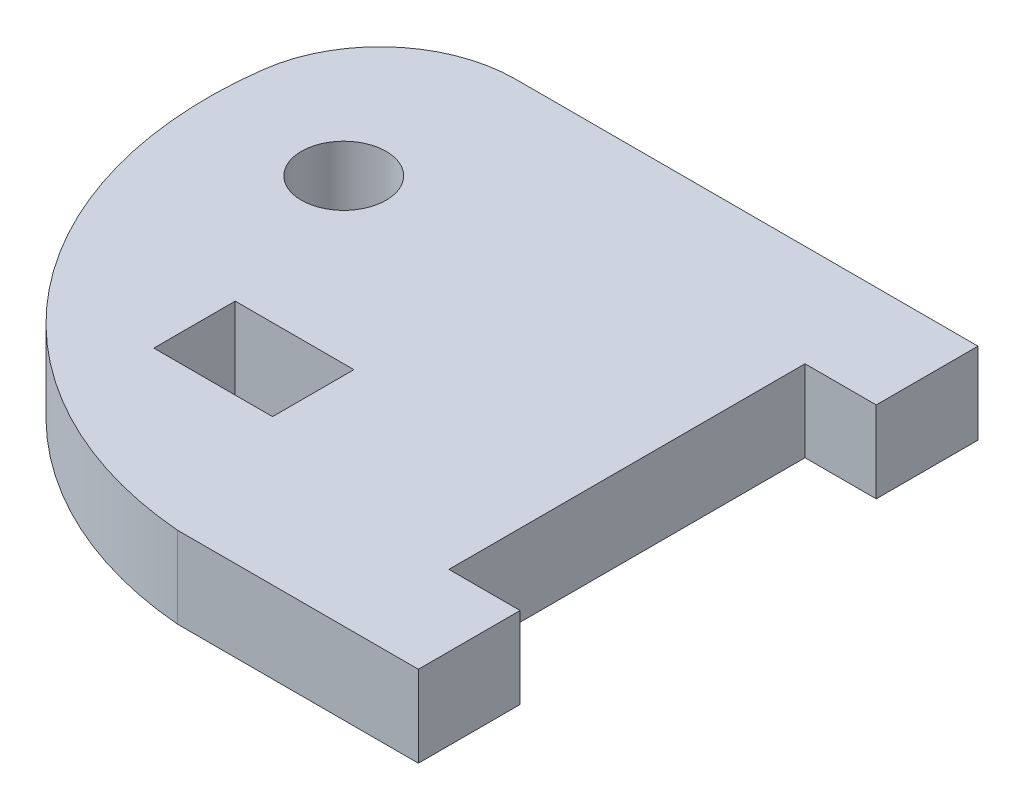
ISO-10303-21;
HEADER;
FILE_DESCRIPTION(('STEP AP214'),'2;1');
FILE_NAME('part.step','',(''),(''),'','','');
FILE_SCHEMA(('AUTOMOTIVE_DESIGN { 1 0 10303 214 1 1 1 1 }'));
ENDSEC;
DATA;
#1=APPLICATION_CONTEXT('core data for automotive mechanical design processes');
#2=APPLICATION_PROTOCOL_DEFINITION('international standard','automotive_design',2000,#1);
#3=PRODUCT_CONTEXT('',#1,'mechanical');
#4=PRODUCT('Part','Part','',(#3));
#5=PRODUCT_RELATED_PRODUCT_CATEGORY('part','',(#4));
#6=PRODUCT_DEFINITION_FORMATION('','',#4);
#7=PRODUCT_DEFINITION_CONTEXT('part definition',#1,'design');
#8=PRODUCT_DEFINITION('design','',#6,#7);
#9=PRODUCT_DEFINITION_SHAPE('','',#8);
#10=(LENGTH_UNIT() NAMED_UNIT(*) SI_UNIT(.MILLI.,.METRE.));
#11=(NAMED_UNIT(*) PLANE_ANGLE_UNIT() SI_UNIT($,.RADIAN.));
#12=(NAMED_UNIT(*) SI_UNIT($,.STERADIAN.) SOLID_ANGLE_UNIT());
#13=UNCERTAINTY_MEASURE_WITH_UNIT(LENGTH_MEASURE(1.E-05),#10,'distance_accuracy_value','');
#14=(GEOMETRIC_REPRESENTATION_CONTEXT(3) GLOBAL_UNCERTAINTY_ASSIGNED_CONTEXT((#13)) GLOBAL_UNIT_ASSIGNED_CONTEXT((#10,
#11,#12)) REPRESENTATION_CONTEXT('',''));
#15=CARTESIAN_POINT('',(0.,0.,0.));
#16=DIRECTION('',(0.,0.,1.));
#17=DIRECTION('',(1.,0.,0.));
#18=AXIS2_PLACEMENT_3D('',#15,#16,#17);
#19=CARTESIAN_POINT('',(19.1470471698113,3.048,0.));
#20=DIRECTION('',(0.,-1.,0.));
#21=DIRECTION('',(0.,0.,-1.));
#22=AXIS2_PLACEMENT_3D('',#19,#20,#21);
#23=PLANE('',#22);
#24=DIRECTION('',(0.,0.,-1.));
#25=VECTOR('',#24,1.);
#26=CARTESIAN_POINT('',(34.798,3.048,21.59));
#27=LINE('',#26,#25);
#28=CARTESIAN_POINT('',(34.798,3.048,29.21));
#29=VERTEX_POINT('',#28);
#30=CARTESIAN_POINT('',(34.798,3.048,21.59));
#31=VERTEX_POINT('',#30);
#32=EDGE_CURVE('E167',#29,#31,#27,.T.);
#33=ORIENTED_EDGE('',*,*,#32,.T.);
#34=DIRECTION('',(-1.,0.,0.));
#35=VECTOR('',#34,1.);
#36=CARTESIAN_POINT('',(29.464,3.048,21.59));
#37=LINE('',#36,#35);
#38=CARTESIAN_POINT('',(29.464,3.048,21.59));
#39=VERTEX_POINT('',#38);
#40=EDGE_CURVE('E170',#31,#39,#37,.T.);
#41=ORIENTED_EDGE('',*,*,#40,.T.);
#42=DIRECTION('',(0.,0.,-1.));
#43=VECTOR('',#42,1.);
#44=CARTESIAN_POINT('',(29.464,3.048,21.59));
#45=LINE('',#44,#43);
#46=CARTESIAN_POINT('',(29.464,3.048,-5.08000000000001));
#47=VERTEX_POINT('',#46);
#48=EDGE_CURVE('E173',#39,#47,#45,.T.);
#49=ORIENTED_EDGE('',*,*,#48,.T.);
#50=DIRECTION('',(1.,0.,0.));
#51=VECTOR('',#50,1.);
#52=CARTESIAN_POINT('',(29.464,3.048,-5.08000000000001));
#53=LINE('',#52,#51);
#54=CARTESIAN_POINT('',(34.798,3.048,-5.08000000000001));
#55=VERTEX_POINT('',#54);
#56=EDGE_CURVE('E175',#47,#55,#53,.T.);
#57=ORIENTED_EDGE('',*,*,#56,.T.);
#58=DIRECTION('',(0.,0.,-1.));
#59=VECTOR('',#58,1.);
#60=CARTESIAN_POINT('',(34.798,3.048,-12.7));
#61=LINE('',#60,#59);
#62=CARTESIAN_POINT('',(34.798,3.048,-12.7));
#63=VERTEX_POINT('',#62);
#64=EDGE_CURVE('E177',#55,#63,#61,.T.);
#65=ORIENTED_EDGE('',*,*,#64,.T.);
#66=DIRECTION('',(-1.,0.,0.));
#67=VECTOR('',#66,1.);
#68=CARTESIAN_POINT('',(0.16922286556138,3.048,-12.7));
#69=LINE('',#68,#67);
#70=CARTESIAN_POINT('',(0.16922286556138,3.048,-12.7));
#71=VERTEX_POINT('',#70);
#72=EDGE_CURVE('E179',#63,#71,#69,.T.);
#73=ORIENTED_EDGE('',*,*,#72,.T.);
#74=CARTESIAN_POINT('',(0.16922286556138,3.048,-2.54000000000001));
#75=DIRECTION('',(0.,1.,0.));
#76=DIRECTION('',(0.,0.,-1.));
#77=AXIS2_PLACEMENT_3D('',#74,#75,#76);
#78=CIRCLE('',#77,10.16);
#79=CARTESIAN_POINT('',(-9.90098238442544,3.048,-3.88780051310933));
#80=VERTEX_POINT('',#79);
#81=EDGE_CURVE('E181',#71,#80,#78,.T.);
#82=ORIENTED_EDGE('',*,*,#81,.T.);
#83=CARTESIAN_POINT('',(19.1470471698113,3.048,0.));
#84=DIRECTION('',(0.,1.,0.));
#85=DIRECTION('',(0.,0.,-1.));
#86=AXIS2_PLACEMENT_3D('',#83,#84,#85);
#87=CIRCLE('',#86,29.3070471698113);
#88=CARTESIAN_POINT('',(16.764,3.048,29.21));
#89=VERTEX_POINT('',#88);
#90=EDGE_CURVE('E183',#80,#89,#87,.T.);
#91=ORIENTED_EDGE('',*,*,#90,.T.);
#92=DIRECTION('',(1.,0.,0.));
#93=VECTOR('',#92,1.);
#94=CARTESIAN_POINT('',(34.798,3.048,29.21));
#95=LINE('',#94,#93);
#96=EDGE_CURVE('E185',#89,#29,#95,.T.);
#97=ORIENTED_EDGE('',*,*,#96,.T.);
#98=EDGE_LOOP('',(#33,#41,#49,#57,#65,#73,#82,#91,#97));
#99=FACE_BOUND('',#98,.T.);
#100=DIRECTION('',(0.,0.,-1.));
#101=VECTOR('',#100,1.);
#102=CARTESIAN_POINT('',(12.954,3.048,12.192));
#103=LINE('',#102,#101);
#104=CARTESIAN_POINT('',(12.954,3.048,18.288));
#105=VERTEX_POINT('',#104);
#106=CARTESIAN_POINT('',(12.954,3.048,12.192));
#107=VERTEX_POINT('',#106);
#108=EDGE_CURVE('E128',#105,#107,#103,.T.);
#109=ORIENTED_EDGE('',*,*,#108,.F.);
#110=DIRECTION('',(1.,0.,0.));
#111=VECTOR('',#110,1.);
#112=CARTESIAN_POINT('',(12.954,3.048,18.288));
#113=LINE('',#112,#111);
#114=CARTESIAN_POINT('',(4.064,3.048,18.288));
#115=VERTEX_POINT('',#114);
#116=EDGE_CURVE('E151',#115,#105,#113,.T.);
#117=ORIENTED_EDGE('',*,*,#116,.F.);
#118=DIRECTION('',(0.,0.,1.));
#119=VECTOR('',#118,1.);
#120=CARTESIAN_POINT('',(4.064,3.048,12.192));
#121=LINE('',#120,#119);
#122=CARTESIAN_POINT('',(4.064,3.048,12.192));
#123=VERTEX_POINT('',#122);
#124=EDGE_CURVE('E149',#123,#115,#121,.T.);
#125=ORIENTED_EDGE('',*,*,#124,.F.);
#126=DIRECTION('',(-1.,0.,0.));
#127=VECTOR('',#126,1.);
#128=CARTESIAN_POINT('',(12.954,3.048,12.192));
#129=LINE('',#128,#127);
#130=EDGE_CURVE('E136',#107,#123,#129,.T.);
#131=ORIENTED_EDGE('',*,*,#130,.F.);
#132=EDGE_LOOP('',(#109,#117,#125,#131));
#133=FACE_BOUND('',#132,.T.);
#134=CARTESIAN_POINT('',(0.,3.048,0.));
#135=DIRECTION('',(0.,1.,0.));
#136=DIRECTION('',(0.,0.,1.));
#137=AXIS2_PLACEMENT_3D('',#134,#135,#136);
#138=CIRCLE('',#137,3.175);
#139=CARTESIAN_POINT('',(0.,3.048,3.17499999999999));
#140=VERTEX_POINT('',#139);
#141=EDGE_CURVE('E157',#140,#140,#138,.T.);
#142=ORIENTED_EDGE('',*,*,#141,.F.);
#143=EDGE_LOOP('',(#142));
#144=FACE_BOUND('',#143,.T.);
#145=ADVANCED_FACE('F33',(#99,#133,#144),#23,.F.);
#146=CARTESIAN_POINT('',(19.1470471698113,-3.048,0.));
#147=DIRECTION('',(0.,-1.,0.));
#148=DIRECTION('',(0.,0.,-1.));
#149=AXIS2_PLACEMENT_3D('',#146,#147,#148);
#150=PLANE('',#149);
#151=DIRECTION('',(1.,0.,0.));
#152=VECTOR('',#151,1.);
#153=CARTESIAN_POINT('',(12.954,-3.048,18.288));
#154=LINE('',#153,#152);
#155=CARTESIAN_POINT('',(4.064,-3.048,18.288));
#156=VERTEX_POINT('',#155);
#157=CARTESIAN_POINT('',(12.954,-3.048,18.288));
#158=VERTEX_POINT('',#157);
#159=EDGE_CURVE('E137',#156,#158,#154,.T.);
#160=ORIENTED_EDGE('',*,*,#159,.T.);
#161=DIRECTION('',(0.,0.,-1.));
#162=VECTOR('',#161,1.);
#163=CARTESIAN_POINT('',(12.954,-3.048,12.192));
#164=LINE('',#163,#162);
#165=CARTESIAN_POINT('',(12.954,-3.048,12.192));
#166=VERTEX_POINT('',#165);
#167=EDGE_CURVE('E56',#158,#166,#164,.T.);
#168=ORIENTED_EDGE('',*,*,#167,.T.);
#169=DIRECTION('',(-1.,0.,0.));
#170=VECTOR('',#169,1.);
#171=CARTESIAN_POINT('',(12.954,-3.048,12.192));
#172=LINE('',#171,#170);
#173=CARTESIAN_POINT('',(4.064,-3.048,12.192));
#174=VERTEX_POINT('',#173);
#175=EDGE_CURVE('E143',#166,#174,#172,.T.);
#176=ORIENTED_EDGE('',*,*,#175,.T.);
#177=DIRECTION('',(0.,0.,1.));
#178=VECTOR('',#177,1.);
#179=CARTESIAN_POINT('',(4.064,-3.048,12.192));
#180=LINE('',#179,#178);
#181=EDGE_CURVE('E159',#174,#156,#180,.T.);
#182=ORIENTED_EDGE('',*,*,#181,.T.);
#183=EDGE_LOOP('',(#160,#168,#176,#182));
#184=FACE_BOUND('',#183,.T.);
#185=DIRECTION('',(0.,0.,-1.));
#186=VECTOR('',#185,1.);
#187=CARTESIAN_POINT('',(34.798,-3.048,21.59));
#188=LINE('',#187,#186);
#189=CARTESIAN_POINT('',(34.798,-3.048,29.21));
#190=VERTEX_POINT('',#189);
#191=CARTESIAN_POINT('',(34.798,-3.048,21.59));
#192=VERTEX_POINT('',#191);
#193=EDGE_CURVE('E144',#190,#192,#188,.T.);
#194=ORIENTED_EDGE('',*,*,#193,.F.);
#195=DIRECTION('',(1.,0.,0.));
#196=VECTOR('',#195,1.);
#197=CARTESIAN_POINT('',(34.798,-3.048,29.21));
#198=LINE('',#197,#196);
#199=CARTESIAN_POINT('',(16.764,-3.048,29.21));
#200=VERTEX_POINT('',#199);
#201=EDGE_CURVE('E171',#200,#190,#198,.T.);
#202=ORIENTED_EDGE('',*,*,#201,.F.);
#203=CARTESIAN_POINT('',(19.1470471698113,-3.048,0.));
#204=DIRECTION('',(0.,1.,0.));
#205=DIRECTION('',(0.,0.,-1.));
#206=AXIS2_PLACEMENT_3D('',#203,#204,#205);
#207=CIRCLE('',#206,29.3070471698113);
#208=CARTESIAN_POINT('',(-9.90098238442544,-3.048,-3.88780051310933));
#209=VERTEX_POINT('',#208);
#210=EDGE_CURVE('E202',#209,#200,#207,.T.);
#211=ORIENTED_EDGE('',*,*,#210,.F.);
#212=CARTESIAN_POINT('',(0.16922286556138,-3.048,-2.54000000000001));
#213=DIRECTION('',(0.,1.,0.));
#214=DIRECTION('',(0.,0.,-1.));
#215=AXIS2_PLACEMENT_3D('',#212,#213,#214);
#216=CIRCLE('',#215,10.16);
#217=CARTESIAN_POINT('',(0.16922286556138,-3.048,-12.7));
#218=VERTEX_POINT('',#217);
#219=EDGE_CURVE('E200',#218,#209,#216,.T.);
#220=ORIENTED_EDGE('',*,*,#219,.F.);
#221=DIRECTION('',(-1.,0.,0.));
#222=VECTOR('',#221,1.);
#223=CARTESIAN_POINT('',(0.16922286556138,-3.048,-12.7));
#224=LINE('',#223,#222);
#225=CARTESIAN_POINT('',(34.798,-3.048,-12.7));
#226=VERTEX_POINT('',#225);
#227=EDGE_CURVE('E198',#226,#218,#224,.T.);
#228=ORIENTED_EDGE('',*,*,#227,.F.);
#229=DIRECTION('',(0.,0.,-1.));
#230=VECTOR('',#229,1.);
#231=CARTESIAN_POINT('',(34.798,-3.048,-12.7));
#232=LINE('',#231,#230);
#233=CARTESIAN_POINT('',(34.798,-3.048,-5.08000000000001));
#234=VERTEX_POINT('',#233);
#235=EDGE_CURVE('E196',#234,#226,#232,.T.);
#236=ORIENTED_EDGE('',*,*,#235,.F.);
#237=DIRECTION('',(1.,0.,0.));
#238=VECTOR('',#237,1.);
#239=CARTESIAN_POINT('',(29.464,-3.048,-5.08000000000001));
#240=LINE('',#239,#238);
#241=CARTESIAN_POINT('',(29.464,-3.048,-5.08000000000001));
#242=VERTEX_POINT('',#241);
#243=EDGE_CURVE('E194',#242,#234,#240,.T.);
#244=ORIENTED_EDGE('',*,*,#243,.F.);
#245=DIRECTION('',(0.,0.,-1.));
#246=VECTOR('',#245,1.);
#247=CARTESIAN_POINT('',(29.464,-3.048,21.59));
#248=LINE('',#247,#246);
#249=CARTESIAN_POINT('',(29.464,-3.048,21.59));
#250=VERTEX_POINT('',#249);
#251=EDGE_CURVE('E192',#250,#242,#248,.T.);
#252=ORIENTED_EDGE('',*,*,#251,.F.);
#253=DIRECTION('',(-1.,0.,0.));
#254=VECTOR('',#253,1.);
#255=CARTESIAN_POINT('',(29.464,-3.048,21.59));
#256=LINE('',#255,#254);
#257=EDGE_CURVE('E190',#192,#250,#256,.T.);
#258=ORIENTED_EDGE('',*,*,#257,.F.);
#259=EDGE_LOOP('',(#194,#202,#211,#220,#228,#236,#244,#252,#258));
#260=FACE_BOUND('',#259,.T.);
#261=CARTESIAN_POINT('',(0.,-3.048,0.));
#262=DIRECTION('',(0.,1.,0.));
#263=DIRECTION('',(0.,0.,1.));
#264=AXIS2_PLACEMENT_3D('',#261,#262,#263);
#265=CIRCLE('',#264,3.175);
#266=CARTESIAN_POINT('',(0.,-3.048,3.17499999999999));
#267=VERTEX_POINT('',#266);
#268=EDGE_CURVE('E408',#267,#267,#265,.T.);
#269=ORIENTED_EDGE('',*,*,#268,.T.);
#270=EDGE_LOOP('',(#269));
#271=FACE_BOUND('',#270,.T.);
#272=ADVANCED_FACE('F235',(#184,#260,#271),#150,.T.);
#273=CARTESIAN_POINT('',(34.798,3.048,21.59));
#274=DIRECTION('',(-1.,0.,0.));
#275=DIRECTION('',(0.,0.,1.));
#276=AXIS2_PLACEMENT_3D('',#273,#274,#275);
#277=PLANE('',#276);
#278=ORIENTED_EDGE('',*,*,#193,.T.);
#279=DIRECTION('',(0.,-1.,0.));
#280=VECTOR('',#279,1.);
#281=CARTESIAN_POINT('',(34.798,3.048,21.59));
#282=LINE('',#281,#280);
#283=EDGE_CURVE('E11',#31,#192,#282,.T.);
#284=ORIENTED_EDGE('',*,*,#283,.F.);
#285=ORIENTED_EDGE('',*,*,#32,.F.);
#286=DIRECTION('',(0.,-1.,0.));
#287=VECTOR('',#286,1.);
#288=CARTESIAN_POINT('',(34.798,3.048,29.21));
#289=LINE('',#288,#287);
#290=EDGE_CURVE('E187',#29,#190,#289,.T.);
#291=ORIENTED_EDGE('',*,*,#290,.T.);
#292=EDGE_LOOP('',(#278,#284,#285,#291));
#293=FACE_BOUND('',#292,.T.);
#294=ADVANCED_FACE('F35',(#293),#277,.F.);
#295=CARTESIAN_POINT('',(29.464,3.048,21.59));
#296=DIRECTION('',(0.,0.,1.));
#297=DIRECTION('',(1.,0.,0.));
#298=AXIS2_PLACEMENT_3D('',#295,#296,#297);
#299=PLANE('',#298);
#300=ORIENTED_EDGE('',*,*,#257,.T.);
#301=DIRECTION('',(0.,-1.,0.));
#302=VECTOR('',#301,1.);
#303=CARTESIAN_POINT('',(29.464,3.048,21.59));
#304=LINE('',#303,#302);
#305=EDGE_CURVE('E41',#39,#250,#304,.T.);
#306=ORIENTED_EDGE('',*,*,#305,.F.);
#307=ORIENTED_EDGE('',*,*,#40,.F.);
#308=ORIENTED_EDGE('',*,*,#283,.T.);
#309=EDGE_LOOP('',(#300,#306,#307,#308));
#310=FACE_BOUND('',#309,.T.);
#311=ADVANCED_FACE('F252',(#310),#299,.F.);
#312=CARTESIAN_POINT('',(29.464,3.048,21.59));
#313=DIRECTION('',(-1.,0.,0.));
#314=DIRECTION('',(0.,0.,1.));
#315=AXIS2_PLACEMENT_3D('',#312,#313,#314);
#316=PLANE('',#315);
#317=ORIENTED_EDGE('',*,*,#251,.T.);
#318=DIRECTION('',(0.,-1.,0.));
#319=VECTOR('',#318,1.);
#320=CARTESIAN_POINT('',(29.464,3.048,-5.08000000000001));
#321=LINE('',#320,#319);
#322=EDGE_CURVE('E222',#47,#242,#321,.T.);
#323=ORIENTED_EDGE('',*,*,#322,.F.);
#324=ORIENTED_EDGE('',*,*,#48,.F.);
#325=ORIENTED_EDGE('',*,*,#305,.T.);
#326=EDGE_LOOP('',(#317,#323,#324,#325));
#327=FACE_BOUND('',#326,.T.);
#328=ADVANCED_FACE('F229',(#327),#316,.F.);
#329=CARTESIAN_POINT('',(29.464,3.048,-5.08000000000001));
#330=DIRECTION('',(0.,0.,-1.));
#331=DIRECTION('',(-1.,0.,0.));
#332=AXIS2_PLACEMENT_3D('',#329,#330,#331);
#333=PLANE('',#332);
#334=ORIENTED_EDGE('',*,*,#243,.T.);
#335=DIRECTION('',(0.,-1.,0.));
#336=VECTOR('',#335,1.);
#337=CARTESIAN_POINT('',(34.798,3.048,-5.08000000000001));
#338=LINE('',#337,#336);
#339=EDGE_CURVE('E219',#55,#234,#338,.T.);
#340=ORIENTED_EDGE('',*,*,#339,.F.);
#341=ORIENTED_EDGE('',*,*,#56,.F.);
#342=ORIENTED_EDGE('',*,*,#322,.T.);
#343=EDGE_LOOP('',(#334,#340,#341,#342));
#344=FACE_BOUND('',#343,.T.);
#345=ADVANCED_FACE('F241',(#344),#333,.F.);
#346=CARTESIAN_POINT('',(34.798,3.048,-12.7));
#347=DIRECTION('',(-1.,0.,0.));
#348=DIRECTION('',(0.,0.,1.));
#349=AXIS2_PLACEMENT_3D('',#346,#347,#348);
#350=PLANE('',#349);
#351=ORIENTED_EDGE('',*,*,#235,.T.);
#352=DIRECTION('',(0.,-1.,0.));
#353=VECTOR('',#352,1.);
#354=CARTESIAN_POINT('',(34.798,3.048,-12.7));
#355=LINE('',#354,#353);
#356=EDGE_CURVE('E216',#63,#226,#355,.T.);
#357=ORIENTED_EDGE('',*,*,#356,.F.);
#358=ORIENTED_EDGE('',*,*,#64,.F.);
#359=ORIENTED_EDGE('',*,*,#339,.T.);
#360=EDGE_LOOP('',(#351,#357,#358,#359));
#361=FACE_BOUND('',#360,.T.);
#362=ADVANCED_FACE('F245',(#361),#350,.F.);
#363=CARTESIAN_POINT('',(0.16922286556138,3.048,-12.7));
#364=DIRECTION('',(0.,0.,1.));
#365=DIRECTION('',(1.,0.,0.));
#366=AXIS2_PLACEMENT_3D('',#363,#364,#365);
#367=PLANE('',#366);
#368=ORIENTED_EDGE('',*,*,#227,.T.);
#369=DIRECTION('',(0.,-1.,0.));
#370=VECTOR('',#369,1.);
#371=CARTESIAN_POINT('',(0.16922286556138,3.048,-12.7));
#372=LINE('',#371,#370);
#373=EDGE_CURVE('E213',#71,#218,#372,.T.);
#374=ORIENTED_EDGE('',*,*,#373,.F.);
#375=ORIENTED_EDGE('',*,*,#72,.F.);
#376=ORIENTED_EDGE('',*,*,#356,.T.);
#377=EDGE_LOOP('',(#368,#374,#375,#376));
#378=FACE_BOUND('',#377,.T.);
#379=ADVANCED_FACE('F270',(#378),#367,.F.);
#380=CARTESIAN_POINT('',(0.16922286556138,3.048,-2.54000000000001));
#381=DIRECTION('',(0.,-1.,0.));
#382=DIRECTION('',(0.,0.,-1.));
#383=AXIS2_PLACEMENT_3D('',#380,#381,#382);
#384=CYLINDRICAL_SURFACE('',#383,10.16);
#385=ORIENTED_EDGE('',*,*,#219,.T.);
#386=DIRECTION('',(0.,-1.,0.));
#387=VECTOR('',#386,1.);
#388=CARTESIAN_POINT('',(-9.90098238442544,3.048,-3.88780051310933));
#389=LINE('',#388,#387);
#390=EDGE_CURVE('E210',#80,#209,#389,.T.);
#391=ORIENTED_EDGE('',*,*,#390,.F.);
#392=ORIENTED_EDGE('',*,*,#81,.F.);
#393=ORIENTED_EDGE('',*,*,#373,.T.);
#394=EDGE_LOOP('',(#385,#391,#392,#393));
#395=FACE_BOUND('',#394,.T.);
#396=ADVANCED_FACE('F268',(#395),#384,.T.);
#397=CARTESIAN_POINT('',(19.1470471698113,3.048,0.));
#398=DIRECTION('',(0.,-1.,0.));
#399=DIRECTION('',(0.,0.,-1.));
#400=AXIS2_PLACEMENT_3D('',#397,#398,#399);
#401=CYLINDRICAL_SURFACE('',#400,29.3070471698113);
#402=ORIENTED_EDGE('',*,*,#210,.T.);
#403=DIRECTION('',(0.,-1.,0.));
#404=VECTOR('',#403,1.);
#405=CARTESIAN_POINT('',(16.764,3.048,29.21));
#406=LINE('',#405,#404);
#407=EDGE_CURVE('E207',#89,#200,#406,.T.);
#408=ORIENTED_EDGE('',*,*,#407,.F.);
#409=ORIENTED_EDGE('',*,*,#90,.F.);
#410=ORIENTED_EDGE('',*,*,#390,.T.);
#411=EDGE_LOOP('',(#402,#408,#409,#410));
#412=FACE_BOUND('',#411,.T.);
#413=ADVANCED_FACE('F264',(#412),#401,.T.);
#414=CARTESIAN_POINT('',(34.798,3.048,29.21));
#415=DIRECTION('',(0.,0.,-1.));
#416=DIRECTION('',(-1.,0.,0.));
#417=AXIS2_PLACEMENT_3D('',#414,#415,#416);
#418=PLANE('',#417);
#419=ORIENTED_EDGE('',*,*,#201,.T.);
#420=ORIENTED_EDGE('',*,*,#290,.F.);
#421=ORIENTED_EDGE('',*,*,#96,.F.);
#422=ORIENTED_EDGE('',*,*,#407,.T.);
#423=EDGE_LOOP('',(#419,#420,#421,#422));
#424=FACE_BOUND('',#423,.T.);
#425=ADVANCED_FACE('F259',(#424),#418,.F.);
#426=CARTESIAN_POINT('',(12.954,3.048,12.192));
#427=DIRECTION('',(-1.,0.,0.));
#428=DIRECTION('',(0.,0.,1.));
#429=AXIS2_PLACEMENT_3D('',#426,#427,#428);
#430=PLANE('',#429);
#431=ORIENTED_EDGE('',*,*,#167,.F.);
#432=DIRECTION('',(0.,-1.,0.));
#433=VECTOR('',#432,1.);
#434=CARTESIAN_POINT('',(12.954,3.048,18.288));
#435=LINE('',#434,#433);
#436=EDGE_CURVE('E132',#105,#158,#435,.T.);
#437=ORIENTED_EDGE('',*,*,#436,.F.);
#438=ORIENTED_EDGE('',*,*,#108,.T.);
#439=DIRECTION('',(0.,-1.,0.));
#440=VECTOR('',#439,1.);
#441=CARTESIAN_POINT('',(12.954,3.048,12.192));
#442=LINE('',#441,#440);
#443=EDGE_CURVE('E131',#107,#166,#442,.T.);
#444=ORIENTED_EDGE('',*,*,#443,.T.);
#445=EDGE_LOOP('',(#431,#437,#438,#444));
#446=FACE_BOUND('',#445,.T.);
#447=ADVANCED_FACE('F130',(#446),#430,.T.);
#448=CARTESIAN_POINT('',(12.954,3.048,12.192));
#449=DIRECTION('',(0.,0.,1.));
#450=DIRECTION('',(1.,0.,0.));
#451=AXIS2_PLACEMENT_3D('',#448,#449,#450);
#452=PLANE('',#451);
#453=ORIENTED_EDGE('',*,*,#175,.F.);
#454=ORIENTED_EDGE('',*,*,#443,.F.);
#455=ORIENTED_EDGE('',*,*,#130,.T.);
#456=DIRECTION('',(0.,-1.,0.));
#457=VECTOR('',#456,1.);
#458=CARTESIAN_POINT('',(4.064,3.048,12.192));
#459=LINE('',#458,#457);
#460=EDGE_CURVE('E145',#123,#174,#459,.T.);
#461=ORIENTED_EDGE('',*,*,#460,.T.);
#462=EDGE_LOOP('',(#453,#454,#455,#461));
#463=FACE_BOUND('',#462,.T.);
#464=ADVANCED_FACE('F140',(#463),#452,.T.);
#465=CARTESIAN_POINT('',(4.064,3.048,12.192));
#466=DIRECTION('',(1.,0.,0.));
#467=DIRECTION('',(0.,0.,-1.));
#468=AXIS2_PLACEMENT_3D('',#465,#466,#467);
#469=PLANE('',#468);
#470=ORIENTED_EDGE('',*,*,#181,.F.);
#471=ORIENTED_EDGE('',*,*,#460,.F.);
#472=ORIENTED_EDGE('',*,*,#124,.T.);
#473=DIRECTION('',(0.,-1.,0.));
#474=VECTOR('',#473,1.);
#475=CARTESIAN_POINT('',(4.064,3.048,18.288));
#476=LINE('',#475,#474);
#477=EDGE_CURVE('E48',#115,#156,#476,.T.);
#478=ORIENTED_EDGE('',*,*,#477,.T.);
#479=EDGE_LOOP('',(#470,#471,#472,#478));
#480=FACE_BOUND('',#479,.T.);
#481=ADVANCED_FACE('F311',(#480),#469,.T.);
#482=CARTESIAN_POINT('',(12.954,3.048,18.288));
#483=DIRECTION('',(0.,0.,-1.));
#484=DIRECTION('',(-1.,0.,0.));
#485=AXIS2_PLACEMENT_3D('',#482,#483,#484);
#486=PLANE('',#485);
#487=ORIENTED_EDGE('',*,*,#159,.F.);
#488=ORIENTED_EDGE('',*,*,#477,.F.);
#489=ORIENTED_EDGE('',*,*,#116,.T.);
#490=ORIENTED_EDGE('',*,*,#436,.T.);
#491=EDGE_LOOP('',(#487,#488,#489,#490));
#492=FACE_BOUND('',#491,.T.);
#493=ADVANCED_FACE('F317',(#492),#486,.T.);
#494=CARTESIAN_POINT('',(0.,3.048,0.));
#495=DIRECTION('',(0.,-1.,0.));
#496=DIRECTION('',(0.,0.,-1.));
#497=AXIS2_PLACEMENT_3D('',#494,#495,#496);
#498=CYLINDRICAL_SURFACE('',#497,3.175);
#499=ORIENTED_EDGE('',*,*,#141,.T.);
#500=EDGE_LOOP('',(#499));
#501=FACE_BOUND('',#500,.T.);
#502=ORIENTED_EDGE('',*,*,#268,.F.);
#503=EDGE_LOOP('',(#502));
#504=FACE_BOUND('',#503,.T.);
#505=ADVANCED_FACE('F325',(#501,#504),#498,.F.);
#506=CLOSED_SHELL('',(#145,#272,#294,#311,#328,#345,#362,#379,#396,#413,#425,#447,#464,#481,
#493,#505));
#507=MANIFOLD_SOLID_BREP('B2',#506);
#508=ADVANCED_BREP_SHAPE_REPRESENTATION('',(#18,#507),#14);
#509=SHAPE_DEFINITION_REPRESENTATION(#9,#508);
ENDSEC;
END-ISO-10303-21;
